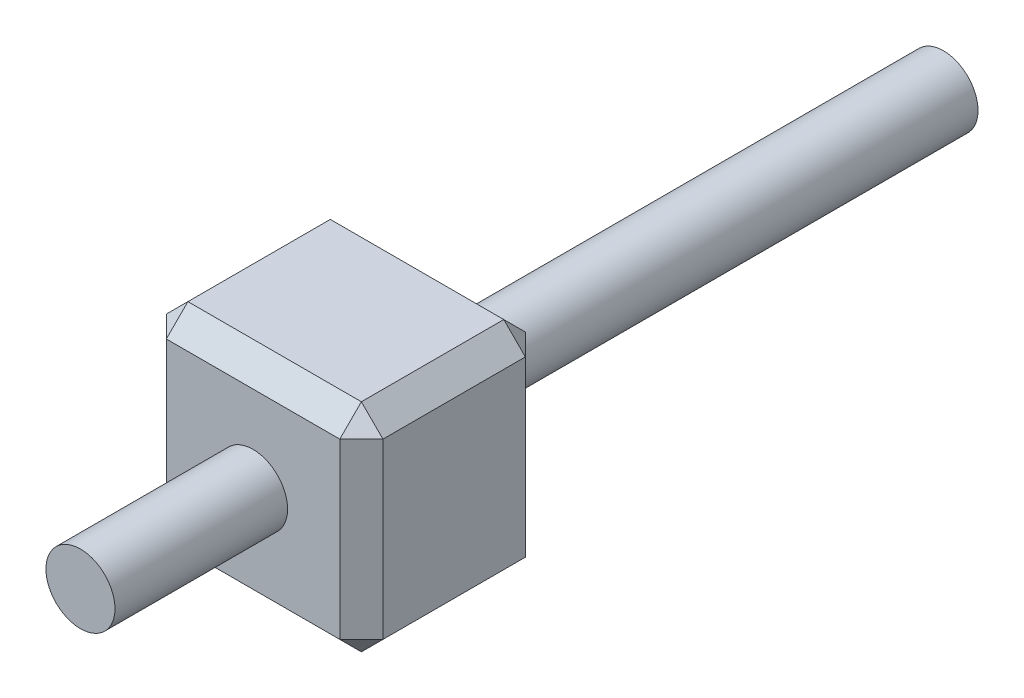
ISO-10303-21;
HEADER;
FILE_DESCRIPTION(('STEP AP214'),'2;1');
FILE_NAME('part.step','',(''),(''),'','','');
FILE_SCHEMA(('AUTOMOTIVE_DESIGN { 1 0 10303 214 1 1 1 1 }'));
ENDSEC;
DATA;
#1=APPLICATION_CONTEXT('core data for automotive mechanical design processes');
#2=APPLICATION_PROTOCOL_DEFINITION('international standard','automotive_design',2000,#1);
#3=PRODUCT_CONTEXT('',#1,'mechanical');
#4=PRODUCT('Part','Part','',(#3));
#5=PRODUCT_RELATED_PRODUCT_CATEGORY('part','',(#4));
#6=PRODUCT_DEFINITION_FORMATION('','',#4);
#7=PRODUCT_DEFINITION_CONTEXT('part definition',#1,'design');
#8=PRODUCT_DEFINITION('design','',#6,#7);
#9=PRODUCT_DEFINITION_SHAPE('','',#8);
#10=(LENGTH_UNIT() NAMED_UNIT(*) SI_UNIT(.MILLI.,.METRE.));
#11=(NAMED_UNIT(*) PLANE_ANGLE_UNIT() SI_UNIT($,.RADIAN.));
#12=(NAMED_UNIT(*) SI_UNIT($,.STERADIAN.) SOLID_ANGLE_UNIT());
#13=UNCERTAINTY_MEASURE_WITH_UNIT(LENGTH_MEASURE(1.E-05),#10,'distance_accuracy_value','');
#14=(GEOMETRIC_REPRESENTATION_CONTEXT(3) GLOBAL_UNCERTAINTY_ASSIGNED_CONTEXT((#13)) GLOBAL_UNIT_ASSIGNED_CONTEXT((#10,
#11,#12)) REPRESENTATION_CONTEXT('',''));
#15=CARTESIAN_POINT('',(0.,0.,0.));
#16=DIRECTION('',(0.,0.,1.));
#17=DIRECTION('',(1.,0.,0.));
#18=AXIS2_PLACEMENT_3D('',#15,#16,#17);
#19=CARTESIAN_POINT('',(-30.5004152134197,21.8097143331672,2.15));
#20=DIRECTION('',(0.,0.,1.));
#21=DIRECTION('',(1.,0.,0.));
#22=AXIS2_PLACEMENT_3D('',#19,#20,#21);
#23=PLANE('',#22);
#24=DIRECTION('',(-1.,0.,0.));
#25=VECTOR('',#24,1.);
#26=CARTESIAN_POINT('',(-30.5004152134197,24.0697143331672,2.15));
#27=LINE('',#26,#25);
#28=CARTESIAN_POINT('',(-28.2404152134197,24.0697143331672,2.15));
#29=VERTEX_POINT('',#28);
#30=CARTESIAN_POINT('',(-30.2504152134197,24.0697143331672,2.15));
#31=VERTEX_POINT('',#30);
#32=EDGE_CURVE('E116',#29,#31,#27,.T.);
#33=ORIENTED_EDGE('',*,*,#32,.T.);
#34=DIRECTION('',(0.,-1.,0.));
#35=VECTOR('',#34,1.);
#36=CARTESIAN_POINT('',(-30.2504152134197,21.8097143331672,2.15));
#37=LINE('',#36,#35);
#38=CARTESIAN_POINT('',(-30.2504152134197,22.0597143331672,2.15));
#39=VERTEX_POINT('',#38);
#40=EDGE_CURVE('E155',#31,#39,#37,.T.);
#41=ORIENTED_EDGE('',*,*,#40,.T.);
#42=DIRECTION('',(1.,0.,0.));
#43=VECTOR('',#42,1.);
#44=CARTESIAN_POINT('',(-27.9904152134197,22.0597143331672,2.15));
#45=LINE('',#44,#43);
#46=CARTESIAN_POINT('',(-28.2404152134197,22.0597143331672,2.15));
#47=VERTEX_POINT('',#46);
#48=EDGE_CURVE('E119',#39,#47,#45,.T.);
#49=ORIENTED_EDGE('',*,*,#48,.T.);
#50=DIRECTION('',(0.,1.,0.));
#51=VECTOR('',#50,1.);
#52=CARTESIAN_POINT('',(-28.2404152134197,24.3197143331672,2.15));
#53=LINE('',#52,#51);
#54=EDGE_CURVE('E111',#47,#29,#53,.T.);
#55=ORIENTED_EDGE('',*,*,#54,.T.);
#56=EDGE_LOOP('',(#33,#41,#49,#55));
#57=FACE_BOUND('',#56,.T.);
#58=CARTESIAN_POINT('',(-29.2454152134197,23.0647143331672,2.15));
#59=DIRECTION('',(0.,0.,1.));
#60=DIRECTION('',(1.,0.,0.));
#61=AXIS2_PLACEMENT_3D('',#58,#59,#60);
#62=CIRCLE('',#61,0.400000000000002);
#63=CARTESIAN_POINT('',(-28.8454152134197,23.0647143331672,2.15));
#64=VERTEX_POINT('',#63);
#65=EDGE_CURVE('E150',#64,#64,#62,.F.);
#66=ORIENTED_EDGE('',*,*,#65,.T.);
#67=EDGE_LOOP('',(#66));
#68=FACE_BOUND('',#67,.T.);
#69=ADVANCED_FACE('F26',(#57,#68),#23,.T.);
#70=CARTESIAN_POINT('',(-30.5004152134197,21.8097143331672,0.));
#71=DIRECTION('',(0.,0.,1.));
#72=DIRECTION('',(1.,0.,0.));
#73=AXIS2_PLACEMENT_3D('',#70,#71,#72);
#74=PLANE('',#73);
#75=DIRECTION('',(-1.,0.,0.));
#76=VECTOR('',#75,1.);
#77=CARTESIAN_POINT('',(-30.5004152134197,22.0597143331672,0.));
#78=LINE('',#77,#76);
#79=CARTESIAN_POINT('',(-28.2404152134197,22.0597143331672,0.));
#80=VERTEX_POINT('',#79);
#81=CARTESIAN_POINT('',(-30.2504152134197,22.0597143331672,0.));
#82=VERTEX_POINT('',#81);
#83=EDGE_CURVE('E170',#80,#82,#78,.T.);
#84=ORIENTED_EDGE('',*,*,#83,.T.);
#85=DIRECTION('',(0.,1.,0.));
#86=VECTOR('',#85,1.);
#87=CARTESIAN_POINT('',(-30.2504152134197,21.8097143331672,0.));
#88=LINE('',#87,#86);
#89=CARTESIAN_POINT('',(-30.2504152134197,24.0697143331672,0.));
#90=VERTEX_POINT('',#89);
#91=EDGE_CURVE('E172',#82,#90,#88,.T.);
#92=ORIENTED_EDGE('',*,*,#91,.T.);
#93=DIRECTION('',(1.,0.,0.));
#94=VECTOR('',#93,1.);
#95=CARTESIAN_POINT('',(-30.5004152134197,24.0697143331672,0.));
#96=LINE('',#95,#94);
#97=CARTESIAN_POINT('',(-28.2404152134197,24.0697143331672,0.));
#98=VERTEX_POINT('',#97);
#99=EDGE_CURVE('E166',#90,#98,#96,.T.);
#100=ORIENTED_EDGE('',*,*,#99,.T.);
#101=DIRECTION('',(0.,-1.,0.));
#102=VECTOR('',#101,1.);
#103=CARTESIAN_POINT('',(-28.2404152134197,21.8097143331672,0.));
#104=LINE('',#103,#102);
#105=EDGE_CURVE('E168',#98,#80,#104,.T.);
#106=ORIENTED_EDGE('',*,*,#105,.T.);
#107=EDGE_LOOP('',(#84,#92,#100,#106));
#108=FACE_BOUND('',#107,.T.);
#109=CARTESIAN_POINT('',(-29.2454152134197,23.0647143331672,0.));
#110=DIRECTION('',(0.,0.,1.));
#111=DIRECTION('',(1.,0.,0.));
#112=AXIS2_PLACEMENT_3D('',#109,#110,#111);
#113=CIRCLE('',#112,0.400000000000002);
#114=CARTESIAN_POINT('',(-28.8454152134197,23.0647143331672,0.));
#115=VERTEX_POINT('',#114);
#116=EDGE_CURVE('E147',#115,#115,#113,.F.);
#117=ORIENTED_EDGE('',*,*,#116,.F.);
#118=EDGE_LOOP('',(#117));
#119=FACE_BOUND('',#118,.T.);
#120=ADVANCED_FACE('F288',(#108,#119),#74,.F.);
#121=CARTESIAN_POINT('',(-30.5004152134197,24.3197143331672,2.15));
#122=DIRECTION('',(1.,0.,0.));
#123=DIRECTION('',(0.,0.,-1.));
#124=AXIS2_PLACEMENT_3D('',#121,#122,#123);
#125=PLANE('',#124);
#126=DIRECTION('',(0.,-1.,0.));
#127=VECTOR('',#126,1.);
#128=CARTESIAN_POINT('',(-30.5004152134197,24.3197143331672,0.25));
#129=LINE('',#128,#127);
#130=CARTESIAN_POINT('',(-30.5004152134197,24.0697143331672,0.25));
#131=VERTEX_POINT('',#130);
#132=CARTESIAN_POINT('',(-30.5004152134197,22.0597143331672,0.25));
#133=VERTEX_POINT('',#132);
#134=EDGE_CURVE('E159',#131,#133,#129,.T.);
#135=ORIENTED_EDGE('',*,*,#134,.T.);
#136=DIRECTION('',(0.,0.,1.));
#137=VECTOR('',#136,1.);
#138=CARTESIAN_POINT('',(-30.5004152134197,22.0597143331672,2.15));
#139=LINE('',#138,#137);
#140=CARTESIAN_POINT('',(-30.5004152134197,22.0597143331672,1.9));
#141=VERTEX_POINT('',#140);
#142=EDGE_CURVE('E164',#133,#141,#139,.T.);
#143=ORIENTED_EDGE('',*,*,#142,.T.);
#144=DIRECTION('',(0.,1.,0.));
#145=VECTOR('',#144,1.);
#146=CARTESIAN_POINT('',(-30.5004152134197,24.3197143331672,1.9));
#147=LINE('',#146,#145);
#148=CARTESIAN_POINT('',(-30.5004152134197,24.0697143331672,1.9));
#149=VERTEX_POINT('',#148);
#150=EDGE_CURVE('E161',#141,#149,#147,.T.);
#151=ORIENTED_EDGE('',*,*,#150,.T.);
#152=DIRECTION('',(0.,0.,-1.));
#153=VECTOR('',#152,1.);
#154=CARTESIAN_POINT('',(-30.5004152134197,24.0697143331672,2.15));
#155=LINE('',#154,#153);
#156=EDGE_CURVE('E157',#149,#131,#155,.T.);
#157=ORIENTED_EDGE('',*,*,#156,.T.);
#158=EDGE_LOOP('',(#135,#143,#151,#157));
#159=FACE_BOUND('',#158,.T.);
#160=ADVANCED_FACE('F28',(#159),#125,.F.);
#161=CARTESIAN_POINT('',(-30.5004152134197,21.8097143331672,2.15));
#162=DIRECTION('',(0.,1.,0.));
#163=DIRECTION('',(0.,0.,1.));
#164=AXIS2_PLACEMENT_3D('',#161,#162,#163);
#165=PLANE('',#164);
#166=DIRECTION('',(-1.,0.,0.));
#167=VECTOR('',#166,1.);
#168=CARTESIAN_POINT('',(-30.5004152134197,21.8097143331672,1.9));
#169=LINE('',#168,#167);
#170=CARTESIAN_POINT('',(-28.2404152134197,21.8097143331672,1.9));
#171=VERTEX_POINT('',#170);
#172=CARTESIAN_POINT('',(-30.2504152134197,21.8097143331672,1.9));
#173=VERTEX_POINT('',#172);
#174=EDGE_CURVE('E179',#171,#173,#169,.T.);
#175=ORIENTED_EDGE('',*,*,#174,.T.);
#176=DIRECTION('',(0.,0.,-1.));
#177=VECTOR('',#176,1.);
#178=CARTESIAN_POINT('',(-30.2504152134197,21.8097143331672,2.15));
#179=LINE('',#178,#177);
#180=CARTESIAN_POINT('',(-30.2504152134197,21.8097143331672,0.25));
#181=VERTEX_POINT('',#180);
#182=EDGE_CURVE('E181',#173,#181,#179,.T.);
#183=ORIENTED_EDGE('',*,*,#182,.T.);
#184=DIRECTION('',(1.,0.,0.));
#185=VECTOR('',#184,1.);
#186=CARTESIAN_POINT('',(-30.5004152134197,21.8097143331672,0.25));
#187=LINE('',#186,#185);
#188=CARTESIAN_POINT('',(-28.2404152134197,21.8097143331672,0.25));
#189=VERTEX_POINT('',#188);
#190=EDGE_CURVE('E177',#181,#189,#187,.T.);
#191=ORIENTED_EDGE('',*,*,#190,.T.);
#192=DIRECTION('',(0.,0.,1.));
#193=VECTOR('',#192,1.);
#194=CARTESIAN_POINT('',(-28.2404152134197,21.8097143331672,2.15));
#195=LINE('',#194,#193);
#196=EDGE_CURVE('E175',#189,#171,#195,.T.);
#197=ORIENTED_EDGE('',*,*,#196,.T.);
#198=EDGE_LOOP('',(#175,#183,#191,#197));
#199=FACE_BOUND('',#198,.T.);
#200=ADVANCED_FACE('F301',(#199),#165,.F.);
#201=CARTESIAN_POINT('',(-27.9904152134197,24.3197143331672,2.15));
#202=DIRECTION('',(-1.,0.,0.));
#203=DIRECTION('',(0.,-1.,0.));
#204=AXIS2_PLACEMENT_3D('',#201,#202,#203);
#205=PLANE('',#204);
#206=DIRECTION('',(0.,-1.,0.));
#207=VECTOR('',#206,1.);
#208=CARTESIAN_POINT('',(-27.9904152134197,21.8097143331672,1.9));
#209=LINE('',#208,#207);
#210=CARTESIAN_POINT('',(-27.9904152134197,24.0697143331672,1.9));
#211=VERTEX_POINT('',#210);
#212=CARTESIAN_POINT('',(-27.9904152134197,22.0597143331672,1.9));
#213=VERTEX_POINT('',#212);
#214=EDGE_CURVE('E129',#211,#213,#209,.T.);
#215=ORIENTED_EDGE('',*,*,#214,.T.);
#216=DIRECTION('',(0.,0.,-1.));
#217=VECTOR('',#216,1.);
#218=CARTESIAN_POINT('',(-27.9904152134197,22.0597143331672,2.15));
#219=LINE('',#218,#217);
#220=CARTESIAN_POINT('',(-27.9904152134197,22.0597143331672,0.25));
#221=VERTEX_POINT('',#220);
#222=EDGE_CURVE('E189',#213,#221,#219,.T.);
#223=ORIENTED_EDGE('',*,*,#222,.T.);
#224=DIRECTION('',(0.,1.,0.));
#225=VECTOR('',#224,1.);
#226=CARTESIAN_POINT('',(-27.9904152134197,24.3197143331672,0.25));
#227=LINE('',#226,#225);
#228=CARTESIAN_POINT('',(-27.9904152134197,24.0697143331672,0.25));
#229=VERTEX_POINT('',#228);
#230=EDGE_CURVE('E186',#221,#229,#227,.T.);
#231=ORIENTED_EDGE('',*,*,#230,.T.);
#232=DIRECTION('',(0.,0.,1.));
#233=VECTOR('',#232,1.);
#234=CARTESIAN_POINT('',(-27.9904152134197,24.0697143331672,2.15));
#235=LINE('',#234,#233);
#236=EDGE_CURVE('E184',#229,#211,#235,.T.);
#237=ORIENTED_EDGE('',*,*,#236,.T.);
#238=EDGE_LOOP('',(#215,#223,#231,#237));
#239=FACE_BOUND('',#238,.T.);
#240=ADVANCED_FACE('F299',(#239),#205,.F.);
#241=CARTESIAN_POINT('',(-30.5004152134197,24.3197143331672,2.15));
#242=DIRECTION('',(0.,-1.,0.));
#243=DIRECTION('',(0.,0.,-1.));
#244=AXIS2_PLACEMENT_3D('',#241,#242,#243);
#245=PLANE('',#244);
#246=DIRECTION('',(1.,0.,0.));
#247=VECTOR('',#246,1.);
#248=CARTESIAN_POINT('',(-27.9904152134197,24.3197143331672,1.9));
#249=LINE('',#248,#247);
#250=CARTESIAN_POINT('',(-30.2504152134197,24.3197143331672,1.9));
#251=VERTEX_POINT('',#250);
#252=CARTESIAN_POINT('',(-28.2404152134197,24.3197143331672,1.9));
#253=VERTEX_POINT('',#252);
#254=EDGE_CURVE('E34',#251,#253,#249,.T.);
#255=ORIENTED_EDGE('',*,*,#254,.T.);
#256=DIRECTION('',(0.,0.,-1.));
#257=VECTOR('',#256,1.);
#258=CARTESIAN_POINT('',(-28.2404152134197,24.3197143331672,2.15));
#259=LINE('',#258,#257);
#260=CARTESIAN_POINT('',(-28.2404152134197,24.3197143331672,0.25));
#261=VERTEX_POINT('',#260);
#262=EDGE_CURVE('E11',#253,#261,#259,.T.);
#263=ORIENTED_EDGE('',*,*,#262,.T.);
#264=DIRECTION('',(-1.,0.,0.));
#265=VECTOR('',#264,1.);
#266=CARTESIAN_POINT('',(-30.5004152134197,24.3197143331672,0.25));
#267=LINE('',#266,#265);
#268=CARTESIAN_POINT('',(-30.2504152134197,24.3197143331672,0.25));
#269=VERTEX_POINT('',#268);
#270=EDGE_CURVE('E192',#261,#269,#267,.T.);
#271=ORIENTED_EDGE('',*,*,#270,.T.);
#272=DIRECTION('',(0.,0.,1.));
#273=VECTOR('',#272,1.);
#274=CARTESIAN_POINT('',(-30.2504152134197,24.3197143331672,2.15));
#275=LINE('',#274,#273);
#276=EDGE_CURVE('E44',#269,#251,#275,.T.);
#277=ORIENTED_EDGE('',*,*,#276,.T.);
#278=EDGE_LOOP('',(#255,#263,#271,#277));
#279=FACE_BOUND('',#278,.T.);
#280=ADVANCED_FACE('F195',(#279),#245,.F.);
#281=CARTESIAN_POINT('',(-29.2454152134197,23.0647143331672,-5.85));
#282=DIRECTION('',(0.,0.,1.));
#283=DIRECTION('',(1.,0.,0.));
#284=AXIS2_PLACEMENT_3D('',#281,#282,#283);
#285=PLANE('',#284);
#286=CARTESIAN_POINT('',(-29.2454152134197,23.0647143331672,-5.85));
#287=DIRECTION('',(0.,0.,1.));
#288=DIRECTION('',(1.,0.,0.));
#289=AXIS2_PLACEMENT_3D('',#286,#287,#288);
#290=CIRCLE('',#289,0.400000000000002);
#291=CARTESIAN_POINT('',(-28.8454152134197,23.0647143331672,-5.85));
#292=VERTEX_POINT('',#291);
#293=EDGE_CURVE('E261',#292,#292,#290,.T.);
#294=ORIENTED_EDGE('',*,*,#293,.F.);
#295=EDGE_LOOP('',(#294));
#296=FACE_BOUND('',#295,.T.);
#297=ADVANCED_FACE('F298',(#296),#285,.F.);
#298=CARTESIAN_POINT('',(-29.2454152134197,23.0647143331672,4.15));
#299=DIRECTION('',(0.,0.,-1.));
#300=DIRECTION('',(-1.,0.,0.));
#301=AXIS2_PLACEMENT_3D('',#298,#299,#300);
#302=CYLINDRICAL_SURFACE('',#301,0.400000000000002);
#303=ORIENTED_EDGE('',*,*,#293,.T.);
#304=EDGE_LOOP('',(#303));
#305=FACE_BOUND('',#304,.T.);
#306=ORIENTED_EDGE('',*,*,#116,.T.);
#307=EDGE_LOOP('',(#306));
#308=FACE_BOUND('',#307,.T.);
#309=ADVANCED_FACE('F273',(#305,#308),#302,.T.);
#310=ORIENTED_EDGE('',*,*,#65,.F.);
#311=EDGE_LOOP('',(#310));
#312=FACE_BOUND('',#311,.T.);
#313=CARTESIAN_POINT('',(-29.2454152134197,23.0647143331672,4.15));
#314=DIRECTION('',(0.,0.,1.));
#315=DIRECTION('',(1.,0.,0.));
#316=AXIS2_PLACEMENT_3D('',#313,#314,#315);
#317=CIRCLE('',#316,0.400000000000002);
#318=CARTESIAN_POINT('',(-28.8454152134197,23.0647143331672,4.15));
#319=VERTEX_POINT('',#318);
#320=EDGE_CURVE('E264',#319,#319,#317,.T.);
#321=ORIENTED_EDGE('',*,*,#320,.F.);
#322=EDGE_LOOP('',(#321));
#323=FACE_BOUND('',#322,.T.);
#324=ADVANCED_FACE('F269',(#312,#323),#302,.T.);
#325=CARTESIAN_POINT('',(-29.2454152134197,23.0647143331672,4.15));
#326=DIRECTION('',(0.,0.,1.));
#327=DIRECTION('',(1.,0.,0.));
#328=AXIS2_PLACEMENT_3D('',#325,#326,#327);
#329=PLANE('',#328);
#330=ORIENTED_EDGE('',*,*,#320,.T.);
#331=EDGE_LOOP('',(#330));
#332=FACE_BOUND('',#331,.T.);
#333=ADVANCED_FACE('F272',(#332),#329,.T.);
#334=CARTESIAN_POINT('',(-27.9904152134197,24.3197143331672,0.25));
#335=DIRECTION('',(-0.707106781186547,0.,0.707106781186547));
#336=DIRECTION('',(0.707106781186548,0.,0.707106781186548));
#337=AXIS2_PLACEMENT_3D('',#334,#335,#336);
#338=PLANE('',#337);
#339=DIRECTION('',(0.707106781186548,0.,0.707106781186548));
#340=VECTOR('',#339,1.);
#341=CARTESIAN_POINT('',(-27.9904152134197,24.0697143331672,0.25));
#342=LINE('',#341,#340);
#343=EDGE_CURVE('E258',#229,#98,#342,.F.);
#344=ORIENTED_EDGE('',*,*,#343,.F.);
#345=ORIENTED_EDGE('',*,*,#230,.F.);
#346=DIRECTION('',(-0.707106781186547,0.,-0.707106781186547));
#347=VECTOR('',#346,1.);
#348=CARTESIAN_POINT('',(-28.1154152134197,22.0597143331672,0.125));
#349=LINE('',#348,#347);
#350=EDGE_CURVE('E255',#80,#221,#349,.F.);
#351=ORIENTED_EDGE('',*,*,#350,.F.);
#352=ORIENTED_EDGE('',*,*,#105,.F.);
#353=EDGE_LOOP('',(#344,#345,#351,#352));
#354=FACE_BOUND('',#353,.T.);
#355=ADVANCED_FACE('F278',(#354),#338,.F.);
#356=CARTESIAN_POINT('',(-27.9904152134197,24.0697143331672,0.25));
#357=DIRECTION('',(0.577350269189626,0.577350269189626,-0.577350269189626));
#358=DIRECTION('',(-0.707106781186547,0.,-0.707106781186547));
#359=AXIS2_PLACEMENT_3D('',#356,#357,#358);
#360=PLANE('',#359);
#361=DIRECTION('',(-0.707106781186547,0.707106781186547,0.));
#362=VECTOR('',#361,1.);
#363=CARTESIAN_POINT('',(-27.9904152134197,24.0697143331672,0.25));
#364=LINE('',#363,#362);
#365=EDGE_CURVE('E250',#229,#261,#364,.T.);
#366=ORIENTED_EDGE('',*,*,#365,.F.);
#367=ORIENTED_EDGE('',*,*,#343,.T.);
#368=DIRECTION('',(0.,-0.707106781186547,-0.707106781186547));
#369=VECTOR('',#368,1.);
#370=CARTESIAN_POINT('',(-28.2404152134197,24.1947143331672,0.125));
#371=LINE('',#370,#369);
#372=EDGE_CURVE('E253',#261,#98,#371,.T.);
#373=ORIENTED_EDGE('',*,*,#372,.F.);
#374=EDGE_LOOP('',(#366,#367,#373));
#375=FACE_BOUND('',#374,.T.);
#376=ADVANCED_FACE('F284',(#375),#360,.T.);
#377=CARTESIAN_POINT('',(-28.2404152134197,21.8097143331672,0.25));
#378=DIRECTION('',(0.577350269189626,-0.577350269189626,-0.577350269189626));
#379=DIRECTION('',(-0.707106781186547,0.,-0.707106781186547));
#380=AXIS2_PLACEMENT_3D('',#377,#378,#379);
#381=PLANE('',#380);
#382=DIRECTION('',(0.,-0.707106781186547,0.707106781186547));
#383=VECTOR('',#382,1.);
#384=CARTESIAN_POINT('',(-28.2404152134197,21.8097143331672,0.25));
#385=LINE('',#384,#383);
#386=EDGE_CURVE('E245',#80,#189,#385,.T.);
#387=ORIENTED_EDGE('',*,*,#386,.F.);
#388=ORIENTED_EDGE('',*,*,#350,.T.);
#389=DIRECTION('',(0.707106781186547,0.707106781186547,0.));
#390=VECTOR('',#389,1.);
#391=CARTESIAN_POINT('',(-28.2404152134197,21.8097143331672,0.25));
#392=LINE('',#391,#390);
#393=EDGE_CURVE('E248',#189,#221,#392,.T.);
#394=ORIENTED_EDGE('',*,*,#393,.F.);
#395=EDGE_LOOP('',(#387,#388,#394));
#396=FACE_BOUND('',#395,.T.);
#397=ADVANCED_FACE('F346',(#396),#381,.T.);
#398=CARTESIAN_POINT('',(-30.5004152134197,24.3197143331672,0.25));
#399=DIRECTION('',(0.,-0.707106781186547,0.707106781186547));
#400=DIRECTION('',(0.,-0.707106781186548,-0.707106781186548));
#401=AXIS2_PLACEMENT_3D('',#398,#399,#400);
#402=PLANE('',#401);
#403=ORIENTED_EDGE('',*,*,#372,.T.);
#404=ORIENTED_EDGE('',*,*,#99,.F.);
#405=DIRECTION('',(0.,0.707106781186547,0.707106781186547));
#406=VECTOR('',#405,1.);
#407=CARTESIAN_POINT('',(-30.2504152134197,24.0697143331672,0.));
#408=LINE('',#407,#406);
#409=EDGE_CURVE('E200',#269,#90,#408,.F.);
#410=ORIENTED_EDGE('',*,*,#409,.F.);
#411=ORIENTED_EDGE('',*,*,#270,.F.);
#412=EDGE_LOOP('',(#403,#404,#410,#411));
#413=FACE_BOUND('',#412,.T.);
#414=ADVANCED_FACE('F202',(#413),#402,.F.);
#415=CARTESIAN_POINT('',(-28.2404152134197,24.3197143331672,2.15));
#416=DIRECTION('',(-0.707106781186547,-0.707106781186547,0.));
#417=DIRECTION('',(0.707106781186548,-0.707106781186548,0.));
#418=AXIS2_PLACEMENT_3D('',#415,#416,#417);
#419=PLANE('',#418);
#420=ORIENTED_EDGE('',*,*,#365,.T.);
#421=ORIENTED_EDGE('',*,*,#262,.F.);
#422=DIRECTION('',(0.707106781186547,-0.707106781186547,0.));
#423=VECTOR('',#422,1.);
#424=CARTESIAN_POINT('',(-28.1154152134197,24.1947143331672,1.9));
#425=LINE('',#424,#423);
#426=EDGE_CURVE('E133',#211,#253,#425,.F.);
#427=ORIENTED_EDGE('',*,*,#426,.F.);
#428=ORIENTED_EDGE('',*,*,#236,.F.);
#429=EDGE_LOOP('',(#420,#421,#427,#428));
#430=FACE_BOUND('',#429,.T.);
#431=ADVANCED_FACE('F375',(#430),#419,.F.);
#432=CARTESIAN_POINT('',(-28.2404152134197,21.8097143331672,2.15));
#433=DIRECTION('',(0.707106781186547,0.,0.707106781186547));
#434=DIRECTION('',(0.707106781186548,0.,-0.707106781186548));
#435=AXIS2_PLACEMENT_3D('',#432,#433,#434);
#436=PLANE('',#435);
#437=DIRECTION('',(-0.707106781186547,0.,0.707106781186547));
#438=VECTOR('',#437,1.);
#439=CARTESIAN_POINT('',(-28.2404152134197,22.0597143331672,2.15));
#440=LINE('',#439,#438);
#441=EDGE_CURVE('E134',#213,#47,#440,.T.);
#442=ORIENTED_EDGE('',*,*,#441,.F.);
#443=ORIENTED_EDGE('',*,*,#214,.F.);
#444=DIRECTION('',(0.707106781186548,0.,-0.707106781186548));
#445=VECTOR('',#444,1.);
#446=CARTESIAN_POINT('',(-28.2404152134197,24.0697143331672,2.15));
#447=LINE('',#446,#445);
#448=EDGE_CURVE('E126',#29,#211,#447,.T.);
#449=ORIENTED_EDGE('',*,*,#448,.F.);
#450=ORIENTED_EDGE('',*,*,#54,.F.);
#451=EDGE_LOOP('',(#442,#443,#449,#450));
#452=FACE_BOUND('',#451,.T.);
#453=ADVANCED_FACE('F128',(#452),#436,.T.);
#454=CARTESIAN_POINT('',(-27.9904152134197,22.0597143331672,2.15));
#455=DIRECTION('',(-0.707106781186547,0.707106781186547,0.));
#456=DIRECTION('',(-0.707106781186548,-0.707106781186548,0.));
#457=AXIS2_PLACEMENT_3D('',#454,#455,#456);
#458=PLANE('',#457);
#459=ORIENTED_EDGE('',*,*,#393,.T.);
#460=ORIENTED_EDGE('',*,*,#222,.F.);
#461=DIRECTION('',(-0.707106781186547,-0.707106781186547,0.));
#462=VECTOR('',#461,1.);
#463=CARTESIAN_POINT('',(-28.1154152134197,21.9347143331672,1.9));
#464=LINE('',#463,#462);
#465=EDGE_CURVE('E239',#171,#213,#464,.F.);
#466=ORIENTED_EDGE('',*,*,#465,.F.);
#467=ORIENTED_EDGE('',*,*,#196,.F.);
#468=EDGE_LOOP('',(#459,#460,#466,#467));
#469=FACE_BOUND('',#468,.T.);
#470=ADVANCED_FACE('F351',(#469),#458,.F.);
#471=CARTESIAN_POINT('',(-30.5004152134197,21.8097143331672,0.25));
#472=DIRECTION('',(0.,0.707106781186547,0.707106781186547));
#473=DIRECTION('',(0.,-0.707106781186548,0.707106781186548));
#474=AXIS2_PLACEMENT_3D('',#471,#472,#473);
#475=PLANE('',#474);
#476=ORIENTED_EDGE('',*,*,#386,.T.);
#477=ORIENTED_EDGE('',*,*,#190,.F.);
#478=DIRECTION('',(0.,0.707106781186547,-0.707106781186547));
#479=VECTOR('',#478,1.);
#480=CARTESIAN_POINT('',(-30.2504152134197,21.9347143331672,0.125));
#481=LINE('',#480,#479);
#482=EDGE_CURVE('E236',#82,#181,#481,.F.);
#483=ORIENTED_EDGE('',*,*,#482,.F.);
#484=ORIENTED_EDGE('',*,*,#83,.F.);
#485=EDGE_LOOP('',(#476,#477,#483,#484));
#486=FACE_BOUND('',#485,.T.);
#487=ADVANCED_FACE('F342',(#486),#475,.F.);
#488=CARTESIAN_POINT('',(-30.5004152134197,24.3197143331672,0.25));
#489=DIRECTION('',(0.707106781186547,0.,0.707106781186547));
#490=DIRECTION('',(0.707106781186548,0.,-0.707106781186548));
#491=AXIS2_PLACEMENT_3D('',#488,#489,#490);
#492=PLANE('',#491);
#493=DIRECTION('',(0.707106781186547,0.,-0.707106781186547));
#494=VECTOR('',#493,1.);
#495=CARTESIAN_POINT('',(-30.2504152134197,24.0697143331672,0.));
#496=LINE('',#495,#494);
#497=EDGE_CURVE('E206',#90,#131,#496,.F.);
#498=ORIENTED_EDGE('',*,*,#497,.F.);
#499=ORIENTED_EDGE('',*,*,#91,.F.);
#500=DIRECTION('',(-0.707106781186547,0.,0.707106781186547));
#501=VECTOR('',#500,1.);
#502=CARTESIAN_POINT('',(-30.5004152134197,22.0597143331672,0.25));
#503=LINE('',#502,#501);
#504=EDGE_CURVE('E212',#133,#82,#503,.F.);
#505=ORIENTED_EDGE('',*,*,#504,.F.);
#506=ORIENTED_EDGE('',*,*,#134,.F.);
#507=EDGE_LOOP('',(#498,#499,#505,#506));
#508=FACE_BOUND('',#507,.T.);
#509=ADVANCED_FACE('F335',(#508),#492,.F.);
#510=CARTESIAN_POINT('',(-30.2504152134197,24.0697143331672,0.));
#511=DIRECTION('',(-0.577350269189626,0.577350269189626,-0.577350269189626));
#512=DIRECTION('',(-0.707106781186547,0.,0.707106781186547));
#513=AXIS2_PLACEMENT_3D('',#510,#511,#512);
#514=PLANE('',#513);
#515=ORIENTED_EDGE('',*,*,#409,.T.);
#516=ORIENTED_EDGE('',*,*,#497,.T.);
#517=DIRECTION('',(-0.707106781186547,-0.707106781186547,0.));
#518=VECTOR('',#517,1.);
#519=CARTESIAN_POINT('',(-30.3754152134197,24.1947143331672,0.25));
#520=LINE('',#519,#518);
#521=EDGE_CURVE('E140',#269,#131,#520,.T.);
#522=ORIENTED_EDGE('',*,*,#521,.F.);
#523=EDGE_LOOP('',(#515,#516,#522));
#524=FACE_BOUND('',#523,.T.);
#525=ADVANCED_FACE('F209',(#524),#514,.T.);
#526=CARTESIAN_POINT('',(-28.2404152134197,24.0697143331672,2.15));
#527=DIRECTION('',(0.577350269189626,0.577350269189626,0.577350269189626));
#528=DIRECTION('',(0.707106781186547,0.,-0.707106781186547));
#529=AXIS2_PLACEMENT_3D('',#526,#527,#528);
#530=PLANE('',#529);
#531=ORIENTED_EDGE('',*,*,#448,.T.);
#532=ORIENTED_EDGE('',*,*,#426,.T.);
#533=DIRECTION('',(0.,-0.707106781186547,0.707106781186547));
#534=VECTOR('',#533,1.);
#535=CARTESIAN_POINT('',(-28.2404152134197,24.0697143331672,2.15));
#536=LINE('',#535,#534);
#537=EDGE_CURVE('E137',#29,#253,#536,.F.);
#538=ORIENTED_EDGE('',*,*,#537,.F.);
#539=EDGE_LOOP('',(#531,#532,#538));
#540=FACE_BOUND('',#539,.T.);
#541=ADVANCED_FACE('F138',(#540),#530,.T.);
#542=CARTESIAN_POINT('',(-28.2404152134197,22.0597143331672,2.15));
#543=DIRECTION('',(0.577350269189626,-0.577350269189626,0.577350269189626));
#544=DIRECTION('',(0.707106781186547,0.,-0.707106781186547));
#545=AXIS2_PLACEMENT_3D('',#542,#543,#544);
#546=PLANE('',#545);
#547=ORIENTED_EDGE('',*,*,#465,.T.);
#548=ORIENTED_EDGE('',*,*,#441,.T.);
#549=DIRECTION('',(0.,-0.707106781186547,-0.707106781186547));
#550=VECTOR('',#549,1.);
#551=CARTESIAN_POINT('',(-28.2404152134197,22.0597143331672,2.15));
#552=LINE('',#551,#550);
#553=EDGE_CURVE('E141',#171,#47,#552,.F.);
#554=ORIENTED_EDGE('',*,*,#553,.F.);
#555=EDGE_LOOP('',(#547,#548,#554));
#556=FACE_BOUND('',#555,.T.);
#557=ADVANCED_FACE('F354',(#556),#546,.T.);
#558=CARTESIAN_POINT('',(-30.5004152134197,22.0597143331672,0.25));
#559=DIRECTION('',(-0.577350269189626,-0.577350269189626,-0.577350269189626));
#560=DIRECTION('',(-0.707106781186547,0.,0.707106781186547));
#561=AXIS2_PLACEMENT_3D('',#558,#559,#560);
#562=PLANE('',#561);
#563=ORIENTED_EDGE('',*,*,#504,.T.);
#564=ORIENTED_EDGE('',*,*,#482,.T.);
#565=DIRECTION('',(0.707106781186547,-0.707106781186547,0.));
#566=VECTOR('',#565,1.);
#567=CARTESIAN_POINT('',(-30.5004152134197,22.0597143331672,0.25));
#568=LINE('',#567,#566);
#569=EDGE_CURVE('E219',#133,#181,#568,.T.);
#570=ORIENTED_EDGE('',*,*,#569,.F.);
#571=EDGE_LOOP('',(#563,#564,#570));
#572=FACE_BOUND('',#571,.T.);
#573=ADVANCED_FACE('F338',(#572),#562,.T.);
#574=CARTESIAN_POINT('',(-30.5004152134197,24.0697143331672,2.15));
#575=DIRECTION('',(0.707106781186547,-0.707106781186547,0.));
#576=DIRECTION('',(0.707106781186548,0.707106781186548,0.));
#577=AXIS2_PLACEMENT_3D('',#574,#575,#576);
#578=PLANE('',#577);
#579=ORIENTED_EDGE('',*,*,#521,.T.);
#580=ORIENTED_EDGE('',*,*,#156,.F.);
#581=DIRECTION('',(0.707106781186547,0.707106781186547,0.));
#582=VECTOR('',#581,1.);
#583=CARTESIAN_POINT('',(-30.5004152134197,24.0697143331672,1.9));
#584=LINE('',#583,#582);
#585=EDGE_CURVE('E217',#251,#149,#584,.F.);
#586=ORIENTED_EDGE('',*,*,#585,.F.);
#587=ORIENTED_EDGE('',*,*,#276,.F.);
#588=EDGE_LOOP('',(#579,#580,#586,#587));
#589=FACE_BOUND('',#588,.T.);
#590=ADVANCED_FACE('F215',(#589),#578,.F.);
#591=CARTESIAN_POINT('',(-30.5004152134197,24.0697143331672,2.15));
#592=DIRECTION('',(0.,0.707106781186547,0.707106781186547));
#593=DIRECTION('',(0.,-0.707106781186548,0.707106781186548));
#594=AXIS2_PLACEMENT_3D('',#591,#592,#593);
#595=PLANE('',#594);
#596=ORIENTED_EDGE('',*,*,#537,.T.);
#597=ORIENTED_EDGE('',*,*,#254,.F.);
#598=DIRECTION('',(0.,0.707106781186547,-0.707106781186547));
#599=VECTOR('',#598,1.);
#600=CARTESIAN_POINT('',(-30.2504152134197,24.1947143331672,2.025));
#601=LINE('',#600,#599);
#602=EDGE_CURVE('E145',#31,#251,#601,.T.);
#603=ORIENTED_EDGE('',*,*,#602,.F.);
#604=ORIENTED_EDGE('',*,*,#32,.F.);
#605=EDGE_LOOP('',(#596,#597,#603,#604));
#606=FACE_BOUND('',#605,.T.);
#607=ADVANCED_FACE('F143',(#606),#595,.T.);
#608=CARTESIAN_POINT('',(-30.5004152134197,22.0597143331672,2.15));
#609=DIRECTION('',(0.,-0.707106781186547,0.707106781186547));
#610=DIRECTION('',(0.,-0.707106781186548,-0.707106781186548));
#611=AXIS2_PLACEMENT_3D('',#608,#609,#610);
#612=PLANE('',#611);
#613=ORIENTED_EDGE('',*,*,#553,.T.);
#614=ORIENTED_EDGE('',*,*,#48,.F.);
#615=DIRECTION('',(0.,0.707106781186547,0.707106781186547));
#616=VECTOR('',#615,1.);
#617=CARTESIAN_POINT('',(-30.2504152134197,22.0597143331672,2.15));
#618=LINE('',#617,#616);
#619=EDGE_CURVE('E224',#173,#39,#618,.T.);
#620=ORIENTED_EDGE('',*,*,#619,.F.);
#621=ORIENTED_EDGE('',*,*,#174,.F.);
#622=EDGE_LOOP('',(#613,#614,#620,#621));
#623=FACE_BOUND('',#622,.T.);
#624=ADVANCED_FACE('F322',(#623),#612,.T.);
#625=CARTESIAN_POINT('',(-30.2504152134197,21.8097143331672,2.15));
#626=DIRECTION('',(0.707106781186547,0.707106781186547,0.));
#627=DIRECTION('',(-0.707106781186548,0.707106781186548,0.));
#628=AXIS2_PLACEMENT_3D('',#625,#626,#627);
#629=PLANE('',#628);
#630=ORIENTED_EDGE('',*,*,#569,.T.);
#631=ORIENTED_EDGE('',*,*,#182,.F.);
#632=DIRECTION('',(-0.707106781186547,0.707106781186547,0.));
#633=VECTOR('',#632,1.);
#634=CARTESIAN_POINT('',(-30.3754152134197,21.9347143331672,1.9));
#635=LINE('',#634,#633);
#636=EDGE_CURVE('E227',#141,#173,#635,.F.);
#637=ORIENTED_EDGE('',*,*,#636,.F.);
#638=ORIENTED_EDGE('',*,*,#142,.F.);
#639=EDGE_LOOP('',(#630,#631,#637,#638));
#640=FACE_BOUND('',#639,.T.);
#641=ADVANCED_FACE('F317',(#640),#629,.F.);
#642=CARTESIAN_POINT('',(-30.5004152134197,24.0697143331672,1.9));
#643=DIRECTION('',(-0.577350269189626,0.577350269189626,0.577350269189626));
#644=DIRECTION('',(0.707106781186547,0.,0.707106781186547));
#645=AXIS2_PLACEMENT_3D('',#642,#643,#644);
#646=PLANE('',#645);
#647=ORIENTED_EDGE('',*,*,#602,.T.);
#648=ORIENTED_EDGE('',*,*,#585,.T.);
#649=DIRECTION('',(0.707106781186547,0.,0.707106781186547));
#650=VECTOR('',#649,1.);
#651=CARTESIAN_POINT('',(-30.5004152134197,24.0697143331672,1.9));
#652=LINE('',#651,#650);
#653=EDGE_CURVE('E222',#31,#149,#652,.F.);
#654=ORIENTED_EDGE('',*,*,#653,.F.);
#655=EDGE_LOOP('',(#647,#648,#654));
#656=FACE_BOUND('',#655,.T.);
#657=ADVANCED_FACE('F221',(#656),#646,.T.);
#658=CARTESIAN_POINT('',(-30.2504152134197,22.0597143331672,2.15));
#659=DIRECTION('',(-0.577350269189626,-0.577350269189626,0.577350269189626));
#660=DIRECTION('',(0.707106781186547,0.,0.707106781186547));
#661=AXIS2_PLACEMENT_3D('',#658,#659,#660);
#662=PLANE('',#661);
#663=ORIENTED_EDGE('',*,*,#636,.T.);
#664=ORIENTED_EDGE('',*,*,#619,.T.);
#665=DIRECTION('',(-0.707106781186547,0.,-0.707106781186547));
#666=VECTOR('',#665,1.);
#667=CARTESIAN_POINT('',(-30.2504152134197,22.0597143331672,2.15));
#668=LINE('',#667,#666);
#669=EDGE_CURVE('E326',#141,#39,#668,.F.);
#670=ORIENTED_EDGE('',*,*,#669,.F.);
#671=EDGE_LOOP('',(#663,#664,#670));
#672=FACE_BOUND('',#671,.T.);
#673=ADVANCED_FACE('F325',(#672),#662,.T.);
#674=CARTESIAN_POINT('',(-30.2504152134197,21.8097143331672,2.15));
#675=DIRECTION('',(-0.707106781186547,0.,0.707106781186547));
#676=DIRECTION('',(0.707106781186548,0.,0.707106781186548));
#677=AXIS2_PLACEMENT_3D('',#674,#675,#676);
#678=PLANE('',#677);
#679=ORIENTED_EDGE('',*,*,#653,.T.);
#680=ORIENTED_EDGE('',*,*,#150,.F.);
#681=ORIENTED_EDGE('',*,*,#669,.T.);
#682=ORIENTED_EDGE('',*,*,#40,.F.);
#683=EDGE_LOOP('',(#679,#680,#681,#682));
#684=FACE_BOUND('',#683,.T.);
#685=ADVANCED_FACE('F330',(#684),#678,.T.);
#686=CLOSED_SHELL('',(#69,#120,#160,#200,#240,#280,#297,#309,#324,#333,#355,#376,#397,#414,#431,
#453,#470,#487,#509,#525,#541,#557,#573,#590,#607,#624,#641,#657,#673,#685));
#687=MANIFOLD_SOLID_BREP('B2',#686);
#688=ADVANCED_BREP_SHAPE_REPRESENTATION('',(#18,#687),#14);
#689=SHAPE_DEFINITION_REPRESENTATION(#9,#688);
ENDSEC;
END-ISO-10303-21;
